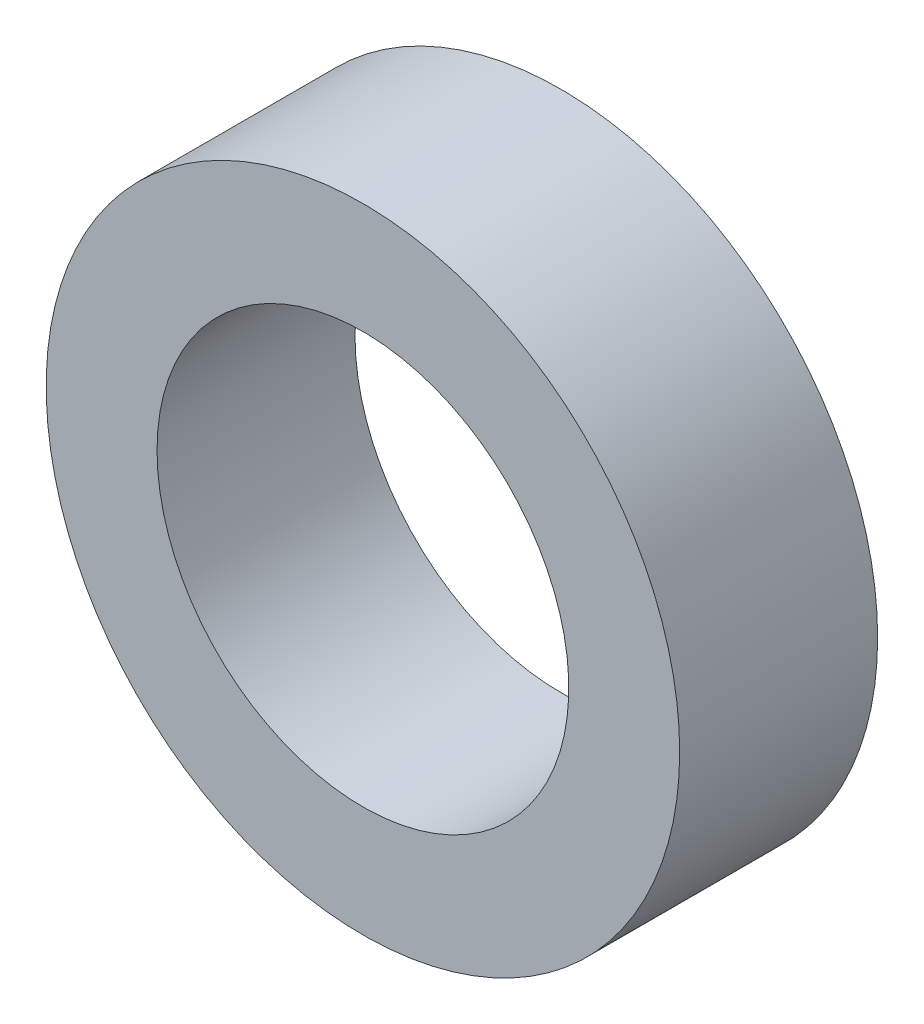
ISO-10303-21;
HEADER;
FILE_DESCRIPTION(('STEP AP214'),'2;1');
FILE_NAME('part.step','',(''),(''),'','','');
FILE_SCHEMA(('AUTOMOTIVE_DESIGN { 1 0 10303 214 1 1 1 1 }'));
ENDSEC;
DATA;
#1=APPLICATION_CONTEXT('core data for automotive mechanical design processes');
#2=APPLICATION_PROTOCOL_DEFINITION('international standard','automotive_design',2000,#1);
#3=PRODUCT_CONTEXT('',#1,'mechanical');
#4=PRODUCT('Part','Part','',(#3));
#5=PRODUCT_RELATED_PRODUCT_CATEGORY('part','',(#4));
#6=PRODUCT_DEFINITION_FORMATION('','',#4);
#7=PRODUCT_DEFINITION_CONTEXT('part definition',#1,'design');
#8=PRODUCT_DEFINITION('design','',#6,#7);
#9=PRODUCT_DEFINITION_SHAPE('','',#8);
#10=(LENGTH_UNIT() NAMED_UNIT(*) SI_UNIT(.MILLI.,.METRE.));
#11=(NAMED_UNIT(*) PLANE_ANGLE_UNIT() SI_UNIT($,.RADIAN.));
#12=(NAMED_UNIT(*) SI_UNIT($,.STERADIAN.) SOLID_ANGLE_UNIT());
#13=UNCERTAINTY_MEASURE_WITH_UNIT(LENGTH_MEASURE(1.E-05),#10,'distance_accuracy_value','');
#14=(GEOMETRIC_REPRESENTATION_CONTEXT(3) GLOBAL_UNCERTAINTY_ASSIGNED_CONTEXT((#13)) GLOBAL_UNIT_ASSIGNED_CONTEXT((#10,
#11,#12)) REPRESENTATION_CONTEXT('',''));
#15=CARTESIAN_POINT('',(0.,0.,0.));
#16=DIRECTION('',(0.,0.,1.));
#17=DIRECTION('',(1.,0.,0.));
#18=AXIS2_PLACEMENT_3D('',#15,#16,#17);
#19=CARTESIAN_POINT('',(0.,0.,3.175));
#20=DIRECTION('',(0.,0.,-1.));
#21=DIRECTION('',(-1.,0.,0.));
#22=AXIS2_PLACEMENT_3D('',#19,#20,#21);
#23=CYLINDRICAL_SURFACE('',#22,5.08);
#24=CARTESIAN_POINT('',(0.,0.,3.175));
#25=DIRECTION('',(0.,0.,1.));
#26=DIRECTION('',(1.,0.,0.));
#27=AXIS2_PLACEMENT_3D('',#24,#25,#26);
#28=CIRCLE('',#27,5.08);
#29=CARTESIAN_POINT('',(5.08,0.,3.175));
#30=VERTEX_POINT('',#29);
#31=EDGE_CURVE('E10',#30,#30,#28,.T.);
#32=ORIENTED_EDGE('',*,*,#31,.F.);
#33=EDGE_LOOP('',(#32));
#34=FACE_BOUND('',#33,.T.);
#35=CARTESIAN_POINT('',(0.,0.,0.));
#36=DIRECTION('',(0.,0.,1.));
#37=DIRECTION('',(1.,0.,0.));
#38=AXIS2_PLACEMENT_3D('',#35,#36,#37);
#39=CIRCLE('',#38,5.08);
#40=CARTESIAN_POINT('',(5.08,0.,0.));
#41=VERTEX_POINT('',#40);
#42=EDGE_CURVE('E33',#41,#41,#39,.T.);
#43=ORIENTED_EDGE('',*,*,#42,.T.);
#44=EDGE_LOOP('',(#43));
#45=FACE_BOUND('',#44,.T.);
#46=ADVANCED_FACE('F30',(#34,#45),#23,.T.);
#47=CARTESIAN_POINT('',(0.,0.,3.175));
#48=DIRECTION('',(0.,0.,1.));
#49=DIRECTION('',(1.,0.,0.));
#50=AXIS2_PLACEMENT_3D('',#47,#48,#49);
#51=PLANE('',#50);
#52=CARTESIAN_POINT('',(0.,0.,3.175));
#53=DIRECTION('',(0.,0.,-1.));
#54=DIRECTION('',(-1.,0.,0.));
#55=AXIS2_PLACEMENT_3D('',#52,#53,#54);
#56=CIRCLE('',#55,3.302);
#57=CARTESIAN_POINT('',(-3.302,0.,3.175));
#58=VERTEX_POINT('',#57);
#59=EDGE_CURVE('E40',#58,#58,#56,.T.);
#60=ORIENTED_EDGE('',*,*,#59,.T.);
#61=EDGE_LOOP('',(#60));
#62=FACE_BOUND('',#61,.T.);
#63=ORIENTED_EDGE('',*,*,#31,.T.);
#64=EDGE_LOOP('',(#63));
#65=FACE_BOUND('',#64,.T.);
#66=ADVANCED_FACE('F48',(#62,#65),#51,.T.);
#67=CARTESIAN_POINT('',(0.,0.,0.));
#68=DIRECTION('',(0.,0.,1.));
#69=DIRECTION('',(1.,0.,0.));
#70=AXIS2_PLACEMENT_3D('',#67,#68,#69);
#71=PLANE('',#70);
#72=CARTESIAN_POINT('',(0.,0.,0.));
#73=DIRECTION('',(0.,0.,-1.));
#74=DIRECTION('',(-1.,0.,0.));
#75=AXIS2_PLACEMENT_3D('',#72,#73,#74);
#76=CIRCLE('',#75,3.302);
#77=CARTESIAN_POINT('',(-3.302,0.,0.));
#78=VERTEX_POINT('',#77);
#79=EDGE_CURVE('E42',#78,#78,#76,.T.);
#80=ORIENTED_EDGE('',*,*,#79,.F.);
#81=EDGE_LOOP('',(#80));
#82=FACE_BOUND('',#81,.T.);
#83=ORIENTED_EDGE('',*,*,#42,.F.);
#84=EDGE_LOOP('',(#83));
#85=FACE_BOUND('',#84,.T.);
#86=ADVANCED_FACE('F53',(#82,#85),#71,.F.);
#87=CARTESIAN_POINT('',(0.,0.,3.175));
#88=DIRECTION('',(0.,0.,-1.));
#89=DIRECTION('',(-1.,0.,0.));
#90=AXIS2_PLACEMENT_3D('',#87,#88,#89);
#91=CYLINDRICAL_SURFACE('',#90,3.302);
#92=ORIENTED_EDGE('',*,*,#59,.F.);
#93=EDGE_LOOP('',(#92));
#94=FACE_BOUND('',#93,.T.);
#95=ORIENTED_EDGE('',*,*,#79,.T.);
#96=EDGE_LOOP('',(#95));
#97=FACE_BOUND('',#96,.T.);
#98=ADVANCED_FACE('F50',(#94,#97),#91,.F.);
#99=CLOSED_SHELL('',(#46,#66,#86,#98));
#100=MANIFOLD_SOLID_BREP('B2',#99);
#101=ADVANCED_BREP_SHAPE_REPRESENTATION('',(#18,#100),#14);
#102=SHAPE_DEFINITION_REPRESENTATION(#9,#101);
ENDSEC;
END-ISO-10303-21;
